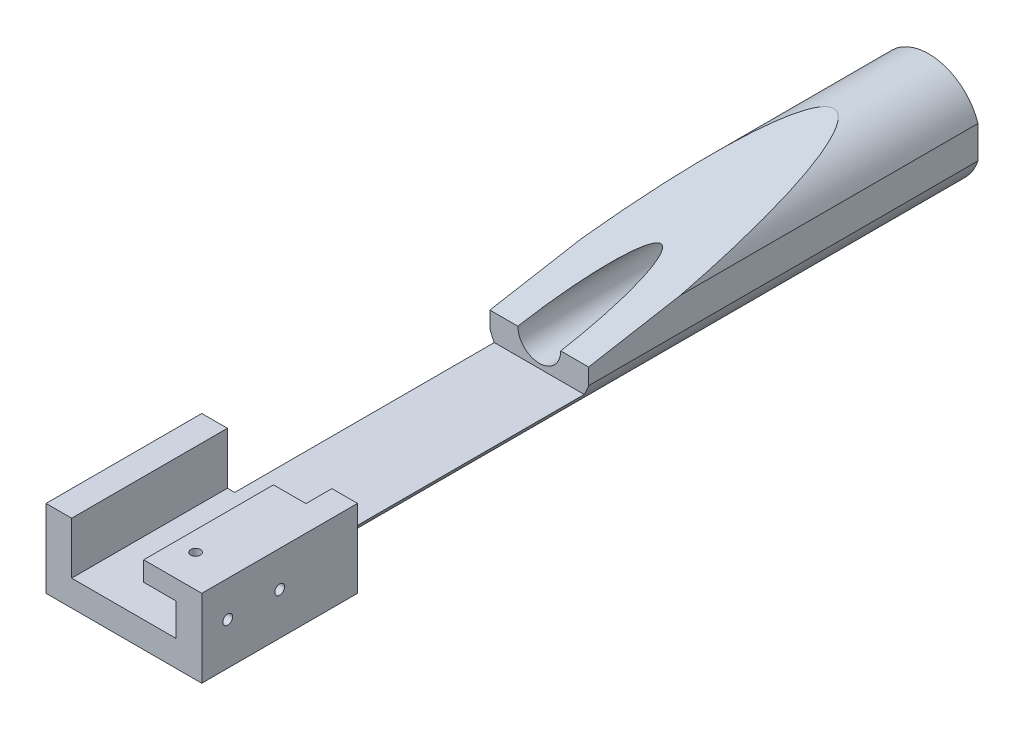
ISO-10303-21;
HEADER;
FILE_DESCRIPTION(('STEP AP214'),'2;1');
FILE_NAME('part.step','',(''),(''),'','','');
FILE_SCHEMA(('AUTOMOTIVE_DESIGN { 1 0 10303 214 1 1 1 1 }'));
ENDSEC;
DATA;
#1=APPLICATION_CONTEXT('core data for automotive mechanical design processes');
#2=APPLICATION_PROTOCOL_DEFINITION('international standard','automotive_design',2000,#1);
#3=PRODUCT_CONTEXT('',#1,'mechanical');
#4=PRODUCT('Part','Part','',(#3));
#5=PRODUCT_RELATED_PRODUCT_CATEGORY('part','',(#4));
#6=PRODUCT_DEFINITION_FORMATION('','',#4);
#7=PRODUCT_DEFINITION_CONTEXT('part definition',#1,'design');
#8=PRODUCT_DEFINITION('design','',#6,#7);
#9=PRODUCT_DEFINITION_SHAPE('','',#8);
#10=(LENGTH_UNIT() NAMED_UNIT(*) SI_UNIT(.MILLI.,.METRE.));
#11=(NAMED_UNIT(*) PLANE_ANGLE_UNIT() SI_UNIT($,.RADIAN.));
#12=(NAMED_UNIT(*) SI_UNIT($,.STERADIAN.) SOLID_ANGLE_UNIT());
#13=UNCERTAINTY_MEASURE_WITH_UNIT(LENGTH_MEASURE(1.E-05),#10,'distance_accuracy_value','');
#14=(GEOMETRIC_REPRESENTATION_CONTEXT(3) GLOBAL_UNCERTAINTY_ASSIGNED_CONTEXT((#13)) GLOBAL_UNIT_ASSIGNED_CONTEXT((#10,
#11,#12)) REPRESENTATION_CONTEXT('',''));
#15=CARTESIAN_POINT('',(0.,0.,0.));
#16=DIRECTION('',(0.,0.,1.));
#17=DIRECTION('',(1.,0.,0.));
#18=AXIS2_PLACEMENT_3D('',#15,#16,#17);
#19=CARTESIAN_POINT('',(0.,0.,50.));
#20=DIRECTION('',(0.,0.,-1.));
#21=DIRECTION('',(-1.,0.,0.));
#22=AXIS2_PLACEMENT_3D('',#19,#20,#21);
#23=CYLINDRICAL_SURFACE('',#22,4.);
#24=CARTESIAN_POINT('',(0.,0.,30.));
#25=DIRECTION('',(0.,0.,-1.));
#26=DIRECTION('',(-1.,0.,0.));
#27=AXIS2_PLACEMENT_3D('',#24,#25,#26);
#28=CIRCLE('',#27,4.);
#29=CARTESIAN_POINT('',(-3.46410161513776,-2.,30.));
#30=VERTEX_POINT('',#29);
#31=CARTESIAN_POINT('',(-3.8,-1.24899959967969,30.));
#32=VERTEX_POINT('',#31);
#33=EDGE_CURVE('E244',#30,#32,#28,.T.);
#34=ORIENTED_EDGE('',*,*,#33,.T.);
#35=DIRECTION('',(0.,0.,-1.));
#36=VECTOR('',#35,1.);
#37=CARTESIAN_POINT('',(-3.8,-1.24899959967969,50.));
#38=LINE('',#37,#36);
#39=CARTESIAN_POINT('',(-3.8,-1.24899959967969,0.));
#40=VERTEX_POINT('',#39);
#41=EDGE_CURVE('E223',#32,#40,#38,.T.);
#42=ORIENTED_EDGE('',*,*,#41,.T.);
#43=CARTESIAN_POINT('',(0.,0.,0.));
#44=DIRECTION('',(0.,0.,1.));
#45=DIRECTION('',(1.,0.,0.));
#46=AXIS2_PLACEMENT_3D('',#43,#44,#45);
#47=CIRCLE('',#46,4.);
#48=CARTESIAN_POINT('',(3.8,-1.24899959967969,0.));
#49=VERTEX_POINT('',#48);
#50=EDGE_CURVE('E243',#40,#49,#47,.T.);
#51=ORIENTED_EDGE('',*,*,#50,.T.);
#52=DIRECTION('',(0.,0.,-1.));
#53=VECTOR('',#52,1.);
#54=CARTESIAN_POINT('',(3.79999999999999,-1.2489995996797,50.));
#55=LINE('',#54,#53);
#56=CARTESIAN_POINT('',(3.8,-1.24899959967969,30.));
#57=VERTEX_POINT('',#56);
#58=EDGE_CURVE('E231',#49,#57,#55,.F.);
#59=ORIENTED_EDGE('',*,*,#58,.T.);
#60=CARTESIAN_POINT('',(3.46410161513776,-2.,30.));
#61=VERTEX_POINT('',#60);
#62=EDGE_CURVE('E249',#57,#61,#28,.T.);
#63=ORIENTED_EDGE('',*,*,#62,.T.);
#64=DIRECTION('',(0.,0.,-1.));
#65=VECTOR('',#64,1.);
#66=CARTESIAN_POINT('',(3.46410161513776,-2.,50.));
#67=LINE('',#66,#65);
#68=CARTESIAN_POINT('',(3.46410161513776,-2.,50.));
#69=VERTEX_POINT('',#68);
#70=EDGE_CURVE('E300',#69,#61,#67,.T.);
#71=ORIENTED_EDGE('',*,*,#70,.F.);
#72=CARTESIAN_POINT('',(0.,0.,50.));
#73=DIRECTION('',(0.,0.,1.));
#74=DIRECTION('',(1.,0.,0.));
#75=AXIS2_PLACEMENT_3D('',#72,#73,#74);
#76=CIRCLE('',#75,4.);
#77=CARTESIAN_POINT('',(0.,-4.,50.));
#78=VERTEX_POINT('',#77);
#79=EDGE_CURVE('E274',#78,#69,#76,.T.);
#80=ORIENTED_EDGE('',*,*,#79,.F.);
#81=CARTESIAN_POINT('',(-3.46410161513776,-2.,50.));
#82=VERTEX_POINT('',#81);
#83=EDGE_CURVE('E289',#82,#78,#76,.T.);
#84=ORIENTED_EDGE('',*,*,#83,.F.);
#85=DIRECTION('',(0.,0.,-1.));
#86=VECTOR('',#85,1.);
#87=CARTESIAN_POINT('',(-3.46410161513776,-2.,50.));
#88=LINE('',#87,#86);
#89=EDGE_CURVE('E294',#30,#82,#88,.F.);
#90=ORIENTED_EDGE('',*,*,#89,.F.);
#91=EDGE_LOOP('',(#34,#42,#51,#59,#63,#71,#80,#84,#90));
#92=FACE_BOUND('',#91,.T.);
#93=ADVANCED_FACE('F37',(#92),#23,.T.);
#94=CARTESIAN_POINT('',(3.8,1.24899959967969,0.));
#95=VERTEX_POINT('',#94);
#96=CARTESIAN_POINT('',(-3.8,1.24899959967969,0.));
#97=VERTEX_POINT('',#96);
#98=EDGE_CURVE('E248',#95,#97,#47,.T.);
#99=ORIENTED_EDGE('',*,*,#98,.T.);
#100=DIRECTION('',(0.,0.,-1.));
#101=VECTOR('',#100,1.);
#102=CARTESIAN_POINT('',(-3.8,1.24899959967969,50.));
#103=LINE('',#102,#101);
#104=CARTESIAN_POINT('',(-3.79999999999999,1.24899959967969,22.9165712776267));
#105=VERTEX_POINT('',#104);
#106=EDGE_CURVE('E220',#97,#105,#103,.F.);
#107=ORIENTED_EDGE('',*,*,#106,.T.);
#108=CARTESIAN_POINT('',(0.,0.,30.));
#109=DIRECTION('',(0.,-0.984807753012208,-0.17364817766693));
#110=DIRECTION('',(0.,0.17364817766693,-0.984807753012208));
#111=AXIS2_PLACEMENT_3D('',#108,#109,#110);
#112=ELLIPSE('',#111,23.0350819325745,4.);
#113=CARTESIAN_POINT('',(3.8,1.24899959967969,22.9165712776268));
#114=VERTEX_POINT('',#113);
#115=EDGE_CURVE('E247',#105,#114,#112,.T.);
#116=ORIENTED_EDGE('',*,*,#115,.T.);
#117=DIRECTION('',(0.,0.,-1.));
#118=VECTOR('',#117,1.);
#119=CARTESIAN_POINT('',(3.79999999999999,1.24899959967969,50.));
#120=LINE('',#119,#118);
#121=EDGE_CURVE('E234',#114,#95,#120,.T.);
#122=ORIENTED_EDGE('',*,*,#121,.T.);
#123=EDGE_LOOP('',(#99,#107,#116,#122));
#124=FACE_BOUND('',#123,.T.);
#125=ADVANCED_FACE('F39',(#124),#23,.T.);
#126=CARTESIAN_POINT('',(-6.,2.,62.));
#127=DIRECTION('',(0.,-1.,0.));
#128=DIRECTION('',(1.,0.,0.));
#129=AXIS2_PLACEMENT_3D('',#126,#127,#128);
#130=PLANE('',#129);
#131=DIRECTION('',(-1.,0.,0.));
#132=VECTOR('',#131,1.);
#133=CARTESIAN_POINT('',(-6.,2.,62.));
#134=LINE('',#133,#132);
#135=CARTESIAN_POINT('',(-4.02499999999999,2.,62.));
#136=VERTEX_POINT('',#135);
#137=CARTESIAN_POINT('',(-6.,2.,62.));
#138=VERTEX_POINT('',#137);
#139=EDGE_CURVE('E279',#136,#138,#134,.T.);
#140=ORIENTED_EDGE('',*,*,#139,.F.);
#141=DIRECTION('',(0.,0.,1.));
#142=VECTOR('',#141,1.);
#143=CARTESIAN_POINT('',(-4.02499999999999,2.,30.));
#144=LINE('',#143,#142);
#145=CARTESIAN_POINT('',(-4.02499999999999,2.,50.));
#146=VERTEX_POINT('',#145);
#147=EDGE_CURVE('E277',#146,#136,#144,.T.);
#148=ORIENTED_EDGE('',*,*,#147,.F.);
#149=DIRECTION('',(-1.,0.,0.));
#150=VECTOR('',#149,1.);
#151=CARTESIAN_POINT('',(-6.,2.,50.));
#152=LINE('',#151,#150);
#153=CARTESIAN_POINT('',(-6.,2.,50.));
#154=VERTEX_POINT('',#153);
#155=EDGE_CURVE('E290',#146,#154,#152,.T.);
#156=ORIENTED_EDGE('',*,*,#155,.T.);
#157=DIRECTION('',(0.,0.,-1.));
#158=VECTOR('',#157,1.);
#159=CARTESIAN_POINT('',(-6.,2.,62.));
#160=LINE('',#159,#158);
#161=EDGE_CURVE('E265',#138,#154,#160,.T.);
#162=ORIENTED_EDGE('',*,*,#161,.F.);
#163=EDGE_LOOP('',(#140,#148,#156,#162));
#164=FACE_BOUND('',#163,.T.);
#165=ADVANCED_FACE('F354',(#164),#130,.F.);
#166=CARTESIAN_POINT('',(0.,0.,0.));
#167=DIRECTION('',(0.,0.,1.));
#168=DIRECTION('',(1.,0.,0.));
#169=AXIS2_PLACEMENT_3D('',#166,#167,#168);
#170=PLANE('',#169);
#171=CARTESIAN_POINT('',(0.,0.,0.));
#172=DIRECTION('',(0.,0.,-1.));
#173=DIRECTION('',(-1.,0.,0.));
#174=AXIS2_PLACEMENT_3D('',#171,#172,#173);
#175=CIRCLE('',#174,1.64999999999999);
#176=CARTESIAN_POINT('',(-1.64999999999999,0.,0.));
#177=VERTEX_POINT('',#176);
#178=EDGE_CURVE('E237',#177,#177,#175,.T.);
#179=ORIENTED_EDGE('',*,*,#178,.F.);
#180=EDGE_LOOP('',(#179));
#181=FACE_BOUND('',#180,.T.);
#182=ORIENTED_EDGE('',*,*,#50,.F.);
#183=DIRECTION('',(0.,-1.,0.));
#184=VECTOR('',#183,1.);
#185=CARTESIAN_POINT('',(-3.79999999999999,2.,0.));
#186=LINE('',#185,#184);
#187=EDGE_CURVE('E215',#97,#40,#186,.T.);
#188=ORIENTED_EDGE('',*,*,#187,.F.);
#189=ORIENTED_EDGE('',*,*,#98,.F.);
#190=DIRECTION('',(0.,1.,0.));
#191=VECTOR('',#190,1.);
#192=CARTESIAN_POINT('',(3.8,2.,0.));
#193=LINE('',#192,#191);
#194=EDGE_CURVE('E226',#49,#95,#193,.T.);
#195=ORIENTED_EDGE('',*,*,#194,.F.);
#196=EDGE_LOOP('',(#182,#188,#189,#195));
#197=FACE_BOUND('',#196,.T.);
#198=ADVANCED_FACE('F415',(#181,#197),#170,.F.);
#199=CARTESIAN_POINT('',(0.,0.,50.));
#200=DIRECTION('',(0.,0.,1.));
#201=DIRECTION('',(1.,0.,0.));
#202=AXIS2_PLACEMENT_3D('',#199,#200,#201);
#203=PLANE('',#202);
#204=ORIENTED_EDGE('',*,*,#83,.T.);
#205=DIRECTION('',(1.,0.,0.));
#206=VECTOR('',#205,1.);
#207=CARTESIAN_POINT('',(-6.,-4.,50.));
#208=LINE('',#207,#206);
#209=CARTESIAN_POINT('',(-6.,-4.,50.));
#210=VERTEX_POINT('',#209);
#211=EDGE_CURVE('E268',#210,#78,#208,.T.);
#212=ORIENTED_EDGE('',*,*,#211,.F.);
#213=DIRECTION('',(0.,-1.,0.));
#214=VECTOR('',#213,1.);
#215=CARTESIAN_POINT('',(-6.,2.,50.));
#216=LINE('',#215,#214);
#217=EDGE_CURVE('E269',#154,#210,#216,.T.);
#218=ORIENTED_EDGE('',*,*,#217,.F.);
#219=ORIENTED_EDGE('',*,*,#155,.F.);
#220=DIRECTION('',(0.,-1.,0.));
#221=VECTOR('',#220,1.);
#222=CARTESIAN_POINT('',(-4.02499999999999,0.,50.));
#223=LINE('',#222,#221);
#224=CARTESIAN_POINT('',(-4.02499999999999,-2.,50.));
#225=VERTEX_POINT('',#224);
#226=EDGE_CURVE('E286',#146,#225,#223,.T.);
#227=ORIENTED_EDGE('',*,*,#226,.T.);
#228=DIRECTION('',(-1.,0.,0.));
#229=VECTOR('',#228,1.);
#230=CARTESIAN_POINT('',(0.,-2.,50.));
#231=LINE('',#230,#229);
#232=EDGE_CURVE('E296',#82,#225,#231,.T.);
#233=ORIENTED_EDGE('',*,*,#232,.F.);
#234=EDGE_LOOP('',(#204,#212,#218,#219,#227,#233));
#235=FACE_BOUND('',#234,.T.);
#236=ADVANCED_FACE('F361',(#235),#203,.F.);
#237=ORIENTED_EDGE('',*,*,#79,.T.);
#238=DIRECTION('',(-1.,0.,0.));
#239=VECTOR('',#238,1.);
#240=CARTESIAN_POINT('',(0.,-2.,50.));
#241=LINE('',#240,#239);
#242=CARTESIAN_POINT('',(4.02499999999999,-2.,50.));
#243=VERTEX_POINT('',#242);
#244=EDGE_CURVE('E304',#243,#69,#241,.T.);
#245=ORIENTED_EDGE('',*,*,#244,.F.);
#246=DIRECTION('',(0.,1.,0.));
#247=VECTOR('',#246,1.);
#248=CARTESIAN_POINT('',(4.02499999999999,0.,50.));
#249=LINE('',#248,#247);
#250=CARTESIAN_POINT('',(4.02499999999999,2.,50.));
#251=VERTEX_POINT('',#250);
#252=EDGE_CURVE('E291',#243,#251,#249,.T.);
#253=ORIENTED_EDGE('',*,*,#252,.T.);
#254=CARTESIAN_POINT('',(6.,2.,50.));
#255=VERTEX_POINT('',#254);
#256=EDGE_CURVE('E260',#255,#251,#152,.T.);
#257=ORIENTED_EDGE('',*,*,#256,.F.);
#258=DIRECTION('',(0.,1.,0.));
#259=VECTOR('',#258,1.);
#260=CARTESIAN_POINT('',(6.,2.,50.));
#261=LINE('',#260,#259);
#262=CARTESIAN_POINT('',(6.,-4.,50.));
#263=VERTEX_POINT('',#262);
#264=EDGE_CURVE('E255',#263,#255,#261,.T.);
#265=ORIENTED_EDGE('',*,*,#264,.F.);
#266=EDGE_CURVE('E256',#78,#263,#208,.T.);
#267=ORIENTED_EDGE('',*,*,#266,.F.);
#268=EDGE_LOOP('',(#237,#245,#253,#257,#265,#267));
#269=FACE_BOUND('',#268,.T.);
#270=ADVANCED_FACE('F384',(#269),#203,.F.);
#271=CARTESIAN_POINT('',(-6.,2.,62.));
#272=DIRECTION('',(1.,0.,0.));
#273=DIRECTION('',(0.,0.,-1.));
#274=AXIS2_PLACEMENT_3D('',#271,#272,#273);
#275=PLANE('',#274);
#276=ORIENTED_EDGE('',*,*,#217,.T.);
#277=DIRECTION('',(0.,0.,-1.));
#278=VECTOR('',#277,1.);
#279=CARTESIAN_POINT('',(-6.,-4.,62.));
#280=LINE('',#279,#278);
#281=CARTESIAN_POINT('',(-6.,-4.,62.));
#282=VERTEX_POINT('',#281);
#283=EDGE_CURVE('E252',#282,#210,#280,.T.);
#284=ORIENTED_EDGE('',*,*,#283,.F.);
#285=DIRECTION('',(0.,-1.,0.));
#286=VECTOR('',#285,1.);
#287=CARTESIAN_POINT('',(-6.,2.,62.));
#288=LINE('',#287,#286);
#289=EDGE_CURVE('E283',#138,#282,#288,.T.);
#290=ORIENTED_EDGE('',*,*,#289,.F.);
#291=ORIENTED_EDGE('',*,*,#161,.T.);
#292=EDGE_LOOP('',(#276,#284,#290,#291));
#293=FACE_BOUND('',#292,.T.);
#294=ADVANCED_FACE('F359',(#293),#275,.F.);
#295=CARTESIAN_POINT('',(-6.,-4.,62.));
#296=DIRECTION('',(0.,1.,0.));
#297=DIRECTION('',(-1.,0.,0.));
#298=AXIS2_PLACEMENT_3D('',#295,#296,#297);
#299=PLANE('',#298);
#300=ORIENTED_EDGE('',*,*,#211,.T.);
#301=ORIENTED_EDGE('',*,*,#266,.T.);
#302=DIRECTION('',(0.,0.,-1.));
#303=VECTOR('',#302,1.);
#304=CARTESIAN_POINT('',(6.,-4.,62.));
#305=LINE('',#304,#303);
#306=CARTESIAN_POINT('',(6.,-4.,62.));
#307=VERTEX_POINT('',#306);
#308=EDGE_CURVE('E257',#307,#263,#305,.T.);
#309=ORIENTED_EDGE('',*,*,#308,.F.);
#310=DIRECTION('',(1.,0.,0.));
#311=VECTOR('',#310,1.);
#312=CARTESIAN_POINT('',(-6.,-4.,62.));
#313=LINE('',#312,#311);
#314=EDGE_CURVE('E281',#282,#307,#313,.T.);
#315=ORIENTED_EDGE('',*,*,#314,.F.);
#316=ORIENTED_EDGE('',*,*,#283,.T.);
#317=EDGE_LOOP('',(#300,#301,#309,#315,#316));
#318=FACE_BOUND('',#317,.T.);
#319=ADVANCED_FACE('F366',(#318),#299,.F.);
#320=CARTESIAN_POINT('',(6.,2.,62.));
#321=DIRECTION('',(-1.,0.,0.));
#322=DIRECTION('',(0.,-1.,0.));
#323=AXIS2_PLACEMENT_3D('',#320,#321,#322);
#324=PLANE('',#323);
#325=CARTESIAN_POINT('',(6.,-0.749999999999998,60.));
#326=DIRECTION('',(-1.,0.,0.));
#327=DIRECTION('',(0.,-1.,0.));
#328=AXIS2_PLACEMENT_3D('',#325,#326,#327);
#329=CIRCLE('',#328,0.375);
#330=CARTESIAN_POINT('',(6.,-1.125,60.));
#331=VERTEX_POINT('',#330);
#332=EDGE_CURVE('E206',#331,#331,#329,.T.);
#333=ORIENTED_EDGE('',*,*,#332,.T.);
#334=EDGE_LOOP('',(#333));
#335=FACE_BOUND('',#334,.T.);
#336=CARTESIAN_POINT('',(6.,-0.749999999999998,56.));
#337=DIRECTION('',(-1.,0.,0.));
#338=DIRECTION('',(0.,-1.,0.));
#339=AXIS2_PLACEMENT_3D('',#336,#337,#338);
#340=CIRCLE('',#339,0.375);
#341=CARTESIAN_POINT('',(6.,-1.125,56.));
#342=VERTEX_POINT('',#341);
#343=EDGE_CURVE('E212',#342,#342,#340,.T.);
#344=ORIENTED_EDGE('',*,*,#343,.T.);
#345=EDGE_LOOP('',(#344));
#346=FACE_BOUND('',#345,.T.);
#347=ORIENTED_EDGE('',*,*,#264,.T.);
#348=DIRECTION('',(0.,0.,-1.));
#349=VECTOR('',#348,1.);
#350=CARTESIAN_POINT('',(6.,2.,62.));
#351=LINE('',#350,#349);
#352=CARTESIAN_POINT('',(6.,2.,62.));
#353=VERTEX_POINT('',#352);
#354=EDGE_CURVE('E261',#353,#255,#351,.T.);
#355=ORIENTED_EDGE('',*,*,#354,.F.);
#356=DIRECTION('',(0.,1.,0.));
#357=VECTOR('',#356,1.);
#358=CARTESIAN_POINT('',(6.,2.,62.));
#359=LINE('',#358,#357);
#360=EDGE_CURVE('E278',#307,#353,#359,.T.);
#361=ORIENTED_EDGE('',*,*,#360,.F.);
#362=ORIENTED_EDGE('',*,*,#308,.T.);
#363=EDGE_LOOP('',(#347,#355,#361,#362));
#364=FACE_BOUND('',#363,.T.);
#365=ADVANCED_FACE('F387',(#335,#346,#364),#324,.F.);
#366=CARTESIAN_POINT('',(3.02499999999999,2.,59.5));
#367=DIRECTION('',(0.,1.,0.));
#368=DIRECTION('',(0.,0.,1.));
#369=AXIS2_PLACEMENT_3D('',#366,#367,#368);
#370=CIRCLE('',#369,0.374999999999988);
#371=CARTESIAN_POINT('',(3.02499999999999,2.,59.875));
#372=VERTEX_POINT('',#371);
#373=EDGE_CURVE('E569',#372,#372,#370,.T.);
#374=ORIENTED_EDGE('',*,*,#373,.F.);
#375=EDGE_LOOP('',(#374));
#376=FACE_BOUND('',#375,.T.);
#377=ORIENTED_EDGE('',*,*,#256,.T.);
#378=DIRECTION('',(0.,0.,-1.));
#379=VECTOR('',#378,1.);
#380=CARTESIAN_POINT('',(4.02499999999999,2.,30.));
#381=LINE('',#380,#379);
#382=CARTESIAN_POINT('',(4.02499999999999,2.,52.));
#383=VERTEX_POINT('',#382);
#384=EDGE_CURVE('E297',#383,#251,#381,.T.);
#385=ORIENTED_EDGE('',*,*,#384,.F.);
#386=DIRECTION('',(1.,0.,0.));
#387=VECTOR('',#386,1.);
#388=CARTESIAN_POINT('',(0.,2.,52.));
#389=LINE('',#388,#387);
#390=CARTESIAN_POINT('',(1.52499999999999,2.,52.));
#391=VERTEX_POINT('',#390);
#392=EDGE_CURVE('E179',#391,#383,#389,.T.);
#393=ORIENTED_EDGE('',*,*,#392,.F.);
#394=DIRECTION('',(0.,0.,1.));
#395=VECTOR('',#394,1.);
#396=CARTESIAN_POINT('',(1.52499999999999,2.,52.));
#397=LINE('',#396,#395);
#398=CARTESIAN_POINT('',(1.52499999999999,2.,62.));
#399=VERTEX_POINT('',#398);
#400=EDGE_CURVE('E189',#391,#399,#397,.T.);
#401=ORIENTED_EDGE('',*,*,#400,.T.);
#402=EDGE_CURVE('E275',#353,#399,#134,.T.);
#403=ORIENTED_EDGE('',*,*,#402,.F.);
#404=ORIENTED_EDGE('',*,*,#354,.T.);
#405=EDGE_LOOP('',(#377,#385,#393,#401,#403,#404));
#406=FACE_BOUND('',#405,.T.);
#407=ADVANCED_FACE('F391',(#376,#406),#130,.F.);
#408=CARTESIAN_POINT('',(0.,0.,62.));
#409=DIRECTION('',(0.,0.,1.));
#410=DIRECTION('',(1.,0.,0.));
#411=AXIS2_PLACEMENT_3D('',#408,#409,#410);
#412=PLANE('',#411);
#413=DIRECTION('',(0.,1.,0.));
#414=VECTOR('',#413,1.);
#415=CARTESIAN_POINT('',(-4.02499999999999,-2.,62.));
#416=LINE('',#415,#414);
#417=CARTESIAN_POINT('',(-4.02499999999999,-2.,62.));
#418=VERTEX_POINT('',#417);
#419=EDGE_CURVE('E264',#418,#136,#416,.T.);
#420=ORIENTED_EDGE('',*,*,#419,.T.);
#421=ORIENTED_EDGE('',*,*,#139,.T.);
#422=ORIENTED_EDGE('',*,*,#289,.T.);
#423=ORIENTED_EDGE('',*,*,#314,.T.);
#424=ORIENTED_EDGE('',*,*,#360,.T.);
#425=ORIENTED_EDGE('',*,*,#402,.T.);
#426=DIRECTION('',(0.,-1.,0.));
#427=VECTOR('',#426,1.);
#428=CARTESIAN_POINT('',(1.52499999999999,0.,62.));
#429=LINE('',#428,#427);
#430=CARTESIAN_POINT('',(1.52499999999999,0.500000000000001,62.));
#431=VERTEX_POINT('',#430);
#432=EDGE_CURVE('E192',#399,#431,#429,.T.);
#433=ORIENTED_EDGE('',*,*,#432,.T.);
#434=DIRECTION('',(1.,0.,0.));
#435=VECTOR('',#434,1.);
#436=CARTESIAN_POINT('',(0.,0.500000000000001,62.));
#437=LINE('',#436,#435);
#438=CARTESIAN_POINT('',(4.02499999999999,0.500000000000001,62.));
#439=VERTEX_POINT('',#438);
#440=EDGE_CURVE('E174',#431,#439,#437,.T.);
#441=ORIENTED_EDGE('',*,*,#440,.T.);
#442=DIRECTION('',(0.,1.,0.));
#443=VECTOR('',#442,1.);
#444=CARTESIAN_POINT('',(4.02499999999999,-2.,62.));
#445=LINE('',#444,#443);
#446=CARTESIAN_POINT('',(4.02499999999999,-2.,62.));
#447=VERTEX_POINT('',#446);
#448=EDGE_CURVE('E309',#447,#439,#445,.T.);
#449=ORIENTED_EDGE('',*,*,#448,.F.);
#450=DIRECTION('',(1.,0.,0.));
#451=VECTOR('',#450,1.);
#452=CARTESIAN_POINT('',(-4.02499999999999,-2.,62.));
#453=LINE('',#452,#451);
#454=EDGE_CURVE('E318',#418,#447,#453,.T.);
#455=ORIENTED_EDGE('',*,*,#454,.F.);
#456=EDGE_LOOP('',(#420,#421,#422,#423,#424,#425,#433,#441,#449,#455));
#457=FACE_BOUND('',#456,.T.);
#458=ADVANCED_FACE('F370',(#457),#412,.T.);
#459=CARTESIAN_POINT('',(-4.02499999999999,-2.,30.));
#460=DIRECTION('',(0.,0.,-1.));
#461=DIRECTION('',(-1.,0.,0.));
#462=AXIS2_PLACEMENT_3D('',#459,#460,#461);
#463=PLANE('',#462);
#464=DIRECTION('',(1.,0.,0.));
#465=VECTOR('',#464,1.);
#466=CARTESIAN_POINT('',(-10.,0.,30.));
#467=LINE('',#466,#465);
#468=CARTESIAN_POINT('',(-3.79999999999999,0.,30.));
#469=VERTEX_POINT('',#468);
#470=CARTESIAN_POINT('',(-1.64999999999999,0.,30.));
#471=VERTEX_POINT('',#470);
#472=EDGE_CURVE('E324',#469,#471,#467,.T.);
#473=ORIENTED_EDGE('',*,*,#472,.F.);
#474=DIRECTION('',(0.,-1.,0.));
#475=VECTOR('',#474,1.);
#476=CARTESIAN_POINT('',(-3.8,-2.,30.));
#477=LINE('',#476,#475);
#478=EDGE_CURVE('E217',#469,#32,#477,.T.);
#479=ORIENTED_EDGE('',*,*,#478,.T.);
#480=ORIENTED_EDGE('',*,*,#33,.F.);
#481=DIRECTION('',(-1.,0.,0.));
#482=VECTOR('',#481,1.);
#483=CARTESIAN_POINT('',(-4.02499999999999,-2.,30.));
#484=LINE('',#483,#482);
#485=EDGE_CURVE('E303',#61,#30,#484,.T.);
#486=ORIENTED_EDGE('',*,*,#485,.F.);
#487=ORIENTED_EDGE('',*,*,#62,.F.);
#488=DIRECTION('',(0.,1.,0.));
#489=VECTOR('',#488,1.);
#490=CARTESIAN_POINT('',(3.8,-2.,30.));
#491=LINE('',#490,#489);
#492=CARTESIAN_POINT('',(3.8,0.,30.));
#493=VERTEX_POINT('',#492);
#494=EDGE_CURVE('E228',#57,#493,#491,.T.);
#495=ORIENTED_EDGE('',*,*,#494,.T.);
#496=CARTESIAN_POINT('',(1.64999999999998,0.,30.));
#497=VERTEX_POINT('',#496);
#498=EDGE_CURVE('E315',#497,#493,#467,.T.);
#499=ORIENTED_EDGE('',*,*,#498,.F.);
#500=CARTESIAN_POINT('',(0.,0.,30.));
#501=DIRECTION('',(0.,0.,-1.));
#502=DIRECTION('',(-1.,0.,0.));
#503=AXIS2_PLACEMENT_3D('',#500,#501,#502);
#504=CIRCLE('',#503,1.64999999999999);
#505=EDGE_CURVE('E240',#497,#471,#504,.T.);
#506=ORIENTED_EDGE('',*,*,#505,.T.);
#507=EDGE_LOOP('',(#473,#479,#480,#486,#487,#495,#499,#506));
#508=FACE_BOUND('',#507,.T.);
#509=ADVANCED_FACE('F345',(#508),#463,.F.);
#510=CARTESIAN_POINT('',(-4.02499999999999,-2.,30.));
#511=DIRECTION('',(-1.,0.,0.));
#512=DIRECTION('',(0.,-1.,0.));
#513=AXIS2_PLACEMENT_3D('',#510,#511,#512);
#514=PLANE('',#513);
#515=ORIENTED_EDGE('',*,*,#147,.T.);
#516=ORIENTED_EDGE('',*,*,#419,.F.);
#517=DIRECTION('',(0.,0.,1.));
#518=VECTOR('',#517,1.);
#519=CARTESIAN_POINT('',(-4.02499999999999,-2.,30.));
#520=LINE('',#519,#518);
#521=EDGE_CURVE('E299',#225,#418,#520,.T.);
#522=ORIENTED_EDGE('',*,*,#521,.F.);
#523=ORIENTED_EDGE('',*,*,#226,.F.);
#524=EDGE_LOOP('',(#515,#516,#522,#523));
#525=FACE_BOUND('',#524,.T.);
#526=ADVANCED_FACE('F375',(#525),#514,.F.);
#527=CARTESIAN_POINT('',(4.025,-2.,30.));
#528=DIRECTION('',(1.,0.,0.));
#529=DIRECTION('',(0.,1.,0.));
#530=AXIS2_PLACEMENT_3D('',#527,#528,#529);
#531=PLANE('',#530);
#532=CARTESIAN_POINT('',(4.02499999999999,-0.749999999999998,60.));
#533=DIRECTION('',(-1.,0.,0.));
#534=DIRECTION('',(0.,0.,1.));
#535=AXIS2_PLACEMENT_3D('',#532,#533,#534);
#536=CIRCLE('',#535,0.375);
#537=CARTESIAN_POINT('',(4.02499999999999,-0.749999999999998,60.375));
#538=VERTEX_POINT('',#537);
#539=EDGE_CURVE('E202',#538,#538,#536,.T.);
#540=ORIENTED_EDGE('',*,*,#539,.F.);
#541=EDGE_LOOP('',(#540));
#542=FACE_BOUND('',#541,.T.);
#543=CARTESIAN_POINT('',(4.02499999999999,-0.749999999999998,56.));
#544=DIRECTION('',(-1.,0.,0.));
#545=DIRECTION('',(0.,0.,1.));
#546=AXIS2_PLACEMENT_3D('',#543,#544,#545);
#547=CIRCLE('',#546,0.375);
#548=CARTESIAN_POINT('',(4.02499999999999,-0.749999999999998,56.375));
#549=VERTEX_POINT('',#548);
#550=EDGE_CURVE('E209',#549,#549,#547,.T.);
#551=ORIENTED_EDGE('',*,*,#550,.F.);
#552=EDGE_LOOP('',(#551));
#553=FACE_BOUND('',#552,.T.);
#554=ORIENTED_EDGE('',*,*,#448,.T.);
#555=DIRECTION('',(0.,0.,1.));
#556=VECTOR('',#555,1.);
#557=CARTESIAN_POINT('',(4.02499999999999,0.500000000000001,52.));
#558=LINE('',#557,#556);
#559=CARTESIAN_POINT('',(4.02499999999999,0.500000000000001,52.));
#560=VERTEX_POINT('',#559);
#561=EDGE_CURVE('E52',#560,#439,#558,.T.);
#562=ORIENTED_EDGE('',*,*,#561,.F.);
#563=DIRECTION('',(0.,-1.,0.));
#564=VECTOR('',#563,1.);
#565=CARTESIAN_POINT('',(4.02499999999999,0.,52.));
#566=LINE('',#565,#564);
#567=EDGE_CURVE('E56',#383,#560,#566,.T.);
#568=ORIENTED_EDGE('',*,*,#567,.F.);
#569=ORIENTED_EDGE('',*,*,#384,.T.);
#570=ORIENTED_EDGE('',*,*,#252,.F.);
#571=DIRECTION('',(0.,0.,-1.));
#572=VECTOR('',#571,1.);
#573=CARTESIAN_POINT('',(4.025,-2.,30.));
#574=LINE('',#573,#572);
#575=EDGE_CURVE('E306',#447,#243,#574,.T.);
#576=ORIENTED_EDGE('',*,*,#575,.F.);
#577=EDGE_LOOP('',(#554,#562,#568,#569,#570,#576));
#578=FACE_BOUND('',#577,.T.);
#579=ADVANCED_FACE('F392',(#542,#553,#578),#531,.F.);
#580=CARTESIAN_POINT('',(0.,-2.,0.));
#581=DIRECTION('',(0.,1.,0.));
#582=DIRECTION('',(-1.,0.,0.));
#583=AXIS2_PLACEMENT_3D('',#580,#581,#582);
#584=PLANE('',#583);
#585=ORIENTED_EDGE('',*,*,#89,.T.);
#586=ORIENTED_EDGE('',*,*,#232,.T.);
#587=ORIENTED_EDGE('',*,*,#521,.T.);
#588=ORIENTED_EDGE('',*,*,#454,.T.);
#589=ORIENTED_EDGE('',*,*,#575,.T.);
#590=ORIENTED_EDGE('',*,*,#244,.T.);
#591=ORIENTED_EDGE('',*,*,#70,.T.);
#592=ORIENTED_EDGE('',*,*,#485,.T.);
#593=EDGE_LOOP('',(#585,#586,#587,#588,#589,#590,#591,#592));
#594=FACE_BOUND('',#593,.T.);
#595=ADVANCED_FACE('F377',(#594),#584,.T.);
#596=CARTESIAN_POINT('',(-10.,0.,30.));
#597=DIRECTION('',(0.,-0.984807753012208,-0.17364817766693));
#598=DIRECTION('',(0.,0.17364817766693,-0.984807753012208));
#599=AXIS2_PLACEMENT_3D('',#596,#597,#598);
#600=PLANE('',#599);
#601=ORIENTED_EDGE('',*,*,#115,.F.);
#602=DIRECTION('',(0.,-0.17364817766693,0.984807753012208));
#603=VECTOR('',#602,1.);
#604=CARTESIAN_POINT('',(-3.8,0.,30.));
#605=LINE('',#604,#603);
#606=EDGE_CURVE('E12',#105,#469,#605,.T.);
#607=ORIENTED_EDGE('',*,*,#606,.T.);
#608=ORIENTED_EDGE('',*,*,#472,.T.);
#609=CARTESIAN_POINT('',(0.,0.,30.));
#610=DIRECTION('',(0.,-0.984807753012208,-0.17364817766693));
#611=DIRECTION('',(0.,0.17364817766693,-0.984807753012208));
#612=AXIS2_PLACEMENT_3D('',#609,#610,#611);
#613=ELLIPSE('',#612,9.50197129718694,1.64999999999999);
#614=EDGE_CURVE('E326',#471,#497,#613,.T.);
#615=ORIENTED_EDGE('',*,*,#614,.T.);
#616=ORIENTED_EDGE('',*,*,#498,.T.);
#617=DIRECTION('',(0.,0.17364817766693,-0.984807753012208));
#618=VECTOR('',#617,1.);
#619=CARTESIAN_POINT('',(3.8,0.,30.));
#620=LINE('',#619,#618);
#621=EDGE_CURVE('E45',#493,#114,#620,.T.);
#622=ORIENTED_EDGE('',*,*,#621,.T.);
#623=EDGE_LOOP('',(#601,#607,#608,#615,#616,#622));
#624=FACE_BOUND('',#623,.T.);
#625=ADVANCED_FACE('F336',(#624),#600,.F.);
#626=CARTESIAN_POINT('',(0.,0.,0.));
#627=DIRECTION('',(0.,0.,-1.));
#628=DIRECTION('',(-1.,0.,0.));
#629=AXIS2_PLACEMENT_3D('',#626,#627,#628);
#630=CYLINDRICAL_SURFACE('',#629,1.64999999999999);
#631=ORIENTED_EDGE('',*,*,#178,.T.);
#632=EDGE_LOOP('',(#631));
#633=FACE_BOUND('',#632,.T.);
#634=ORIENTED_EDGE('',*,*,#614,.F.);
#635=ORIENTED_EDGE('',*,*,#505,.F.);
#636=EDGE_LOOP('',(#634,#635));
#637=FACE_BOUND('',#636,.T.);
#638=ADVANCED_FACE('F426',(#633,#637),#630,.F.);
#639=CARTESIAN_POINT('',(3.8,2.,50.));
#640=DIRECTION('',(-1.,0.,0.));
#641=DIRECTION('',(0.,-1.,0.));
#642=AXIS2_PLACEMENT_3D('',#639,#640,#641);
#643=PLANE('',#642);
#644=ORIENTED_EDGE('',*,*,#621,.F.);
#645=ORIENTED_EDGE('',*,*,#494,.F.);
#646=ORIENTED_EDGE('',*,*,#58,.F.);
#647=ORIENTED_EDGE('',*,*,#194,.T.);
#648=ORIENTED_EDGE('',*,*,#121,.F.);
#649=EDGE_LOOP('',(#644,#645,#646,#647,#648));
#650=FACE_BOUND('',#649,.T.);
#651=ADVANCED_FACE('F340',(#650),#643,.F.);
#652=CARTESIAN_POINT('',(-3.79999999999999,2.,50.));
#653=DIRECTION('',(1.,0.,0.));
#654=DIRECTION('',(0.,1.,0.));
#655=AXIS2_PLACEMENT_3D('',#652,#653,#654);
#656=PLANE('',#655);
#657=ORIENTED_EDGE('',*,*,#478,.F.);
#658=ORIENTED_EDGE('',*,*,#606,.F.);
#659=ORIENTED_EDGE('',*,*,#106,.F.);
#660=ORIENTED_EDGE('',*,*,#187,.T.);
#661=ORIENTED_EDGE('',*,*,#41,.F.);
#662=EDGE_LOOP('',(#657,#658,#659,#660,#661));
#663=FACE_BOUND('',#662,.T.);
#664=ADVANCED_FACE('F423',(#663),#656,.F.);
#665=CARTESIAN_POINT('',(4.02499999999999,-0.749999999999998,56.));
#666=DIRECTION('',(-1.,0.,0.));
#667=DIRECTION('',(0.,0.,1.));
#668=AXIS2_PLACEMENT_3D('',#665,#666,#667);
#669=CYLINDRICAL_SURFACE('',#668,0.375);
#670=ORIENTED_EDGE('',*,*,#343,.F.);
#671=EDGE_LOOP('',(#670));
#672=FACE_BOUND('',#671,.T.);
#673=ORIENTED_EDGE('',*,*,#550,.T.);
#674=EDGE_LOOP('',(#673));
#675=FACE_BOUND('',#674,.T.);
#676=ADVANCED_FACE('F493',(#672,#675),#669,.F.);
#677=CARTESIAN_POINT('',(4.02499999999999,-0.749999999999998,60.));
#678=DIRECTION('',(-1.,0.,0.));
#679=DIRECTION('',(0.,0.,1.));
#680=AXIS2_PLACEMENT_3D('',#677,#678,#679);
#681=CYLINDRICAL_SURFACE('',#680,0.375);
#682=ORIENTED_EDGE('',*,*,#332,.F.);
#683=EDGE_LOOP('',(#682));
#684=FACE_BOUND('',#683,.T.);
#685=ORIENTED_EDGE('',*,*,#539,.T.);
#686=EDGE_LOOP('',(#685));
#687=FACE_BOUND('',#686,.T.);
#688=ADVANCED_FACE('F508',(#684,#687),#681,.F.);
#689=CARTESIAN_POINT('',(1.52499999999999,0.,52.));
#690=DIRECTION('',(-1.,0.,0.));
#691=DIRECTION('',(0.,-1.,0.));
#692=AXIS2_PLACEMENT_3D('',#689,#690,#691);
#693=PLANE('',#692);
#694=ORIENTED_EDGE('',*,*,#432,.F.);
#695=ORIENTED_EDGE('',*,*,#400,.F.);
#696=DIRECTION('',(0.,-1.,0.));
#697=VECTOR('',#696,1.);
#698=CARTESIAN_POINT('',(1.52499999999999,0.,52.));
#699=LINE('',#698,#697);
#700=CARTESIAN_POINT('',(1.52499999999999,0.500000000000001,52.));
#701=VERTEX_POINT('',#700);
#702=EDGE_CURVE('E185',#391,#701,#699,.T.);
#703=ORIENTED_EDGE('',*,*,#702,.T.);
#704=DIRECTION('',(0.,0.,1.));
#705=VECTOR('',#704,1.);
#706=CARTESIAN_POINT('',(1.52499999999999,0.500000000000001,52.));
#707=LINE('',#706,#705);
#708=EDGE_CURVE('E169',#701,#431,#707,.T.);
#709=ORIENTED_EDGE('',*,*,#708,.T.);
#710=EDGE_LOOP('',(#694,#695,#703,#709));
#711=FACE_BOUND('',#710,.T.);
#712=ADVANCED_FACE('F187',(#711),#693,.T.);
#713=CARTESIAN_POINT('',(0.,0.500000000000001,52.));
#714=DIRECTION('',(0.,-1.,0.));
#715=DIRECTION('',(0.,0.,-1.));
#716=AXIS2_PLACEMENT_3D('',#713,#714,#715);
#717=PLANE('',#716);
#718=CARTESIAN_POINT('',(3.02499999999999,0.500000000000001,59.5));
#719=DIRECTION('',(0.,-1.,0.));
#720=DIRECTION('',(0.,0.,-1.));
#721=AXIS2_PLACEMENT_3D('',#718,#719,#720);
#722=CIRCLE('',#721,0.374999999999994);
#723=CARTESIAN_POINT('',(3.02499999999999,0.500000000000001,59.125));
#724=VERTEX_POINT('',#723);
#725=EDGE_CURVE('E195',#724,#724,#722,.T.);
#726=ORIENTED_EDGE('',*,*,#725,.F.);
#727=EDGE_LOOP('',(#726));
#728=FACE_BOUND('',#727,.T.);
#729=ORIENTED_EDGE('',*,*,#440,.F.);
#730=ORIENTED_EDGE('',*,*,#708,.F.);
#731=DIRECTION('',(1.,0.,0.));
#732=VECTOR('',#731,1.);
#733=CARTESIAN_POINT('',(0.,0.500000000000001,52.));
#734=LINE('',#733,#732);
#735=EDGE_CURVE('E172',#701,#560,#734,.T.);
#736=ORIENTED_EDGE('',*,*,#735,.T.);
#737=ORIENTED_EDGE('',*,*,#561,.T.);
#738=EDGE_LOOP('',(#729,#730,#736,#737));
#739=FACE_BOUND('',#738,.T.);
#740=ADVANCED_FACE('F171',(#728,#739),#717,.T.);
#741=CARTESIAN_POINT('',(0.,0.,52.));
#742=DIRECTION('',(0.,0.,1.));
#743=DIRECTION('',(1.,0.,0.));
#744=AXIS2_PLACEMENT_3D('',#741,#742,#743);
#745=PLANE('',#744);
#746=ORIENTED_EDGE('',*,*,#702,.F.);
#747=ORIENTED_EDGE('',*,*,#392,.T.);
#748=ORIENTED_EDGE('',*,*,#567,.T.);
#749=ORIENTED_EDGE('',*,*,#735,.F.);
#750=EDGE_LOOP('',(#746,#747,#748,#749));
#751=FACE_BOUND('',#750,.T.);
#752=ADVANCED_FACE('F183',(#751),#745,.F.);
#753=CARTESIAN_POINT('',(3.02499999999999,2.,59.5));
#754=DIRECTION('',(0.,1.,0.));
#755=DIRECTION('',(0.,0.,1.));
#756=AXIS2_PLACEMENT_3D('',#753,#754,#755);
#757=CYLINDRICAL_SURFACE('',#756,0.374999999999994);
#758=ORIENTED_EDGE('',*,*,#373,.T.);
#759=EDGE_LOOP('',(#758));
#760=FACE_BOUND('',#759,.T.);
#761=ORIENTED_EDGE('',*,*,#725,.T.);
#762=EDGE_LOOP('',(#761));
#763=FACE_BOUND('',#762,.T.);
#764=ADVANCED_FACE('F553',(#760,#763),#757,.F.);
#765=CLOSED_SHELL('',(#93,#125,#165,#198,#236,#270,#294,#319,#365,#407,#458,#509,#526,#579,#595,
#625,#638,#651,#664,#676,#688,#712,#740,#752,#764));
#766=MANIFOLD_SOLID_BREP('B2',#765);
#767=ADVANCED_BREP_SHAPE_REPRESENTATION('',(#18,#766),#14);
#768=SHAPE_DEFINITION_REPRESENTATION(#9,#767);
ENDSEC;
END-ISO-10303-21;
